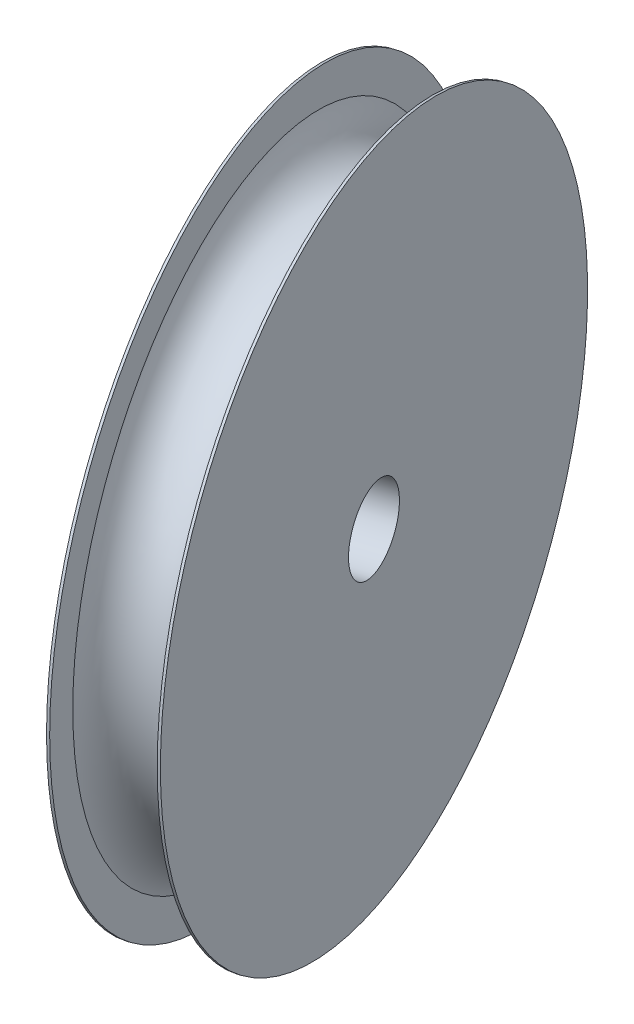
ISO-10303-21;
HEADER;
FILE_DESCRIPTION(('STEP AP214'),'2;1');
FILE_NAME('part.step','',(''),(''),'','','');
FILE_SCHEMA(('AUTOMOTIVE_DESIGN { 1 0 10303 214 1 1 1 1 }'));
ENDSEC;
DATA;
#1=APPLICATION_CONTEXT('core data for automotive mechanical design processes');
#2=APPLICATION_PROTOCOL_DEFINITION('international standard','automotive_design',2000,#1);
#3=PRODUCT_CONTEXT('',#1,'mechanical');
#4=PRODUCT('Part','Part','',(#3));
#5=PRODUCT_RELATED_PRODUCT_CATEGORY('part','',(#4));
#6=PRODUCT_DEFINITION_FORMATION('','',#4);
#7=PRODUCT_DEFINITION_CONTEXT('part definition',#1,'design');
#8=PRODUCT_DEFINITION('design','',#6,#7);
#9=PRODUCT_DEFINITION_SHAPE('','',#8);
#10=(LENGTH_UNIT() NAMED_UNIT(*) SI_UNIT(.MILLI.,.METRE.));
#11=(NAMED_UNIT(*) PLANE_ANGLE_UNIT() SI_UNIT($,.RADIAN.));
#12=(NAMED_UNIT(*) SI_UNIT($,.STERADIAN.) SOLID_ANGLE_UNIT());
#13=UNCERTAINTY_MEASURE_WITH_UNIT(LENGTH_MEASURE(1.E-05),#10,'distance_accuracy_value','');
#14=(GEOMETRIC_REPRESENTATION_CONTEXT(3) GLOBAL_UNCERTAINTY_ASSIGNED_CONTEXT((#13)) GLOBAL_UNIT_ASSIGNED_CONTEXT((#10,
#11,#12)) REPRESENTATION_CONTEXT('',''));
#15=CARTESIAN_POINT('',(0.,0.,0.));
#16=DIRECTION('',(0.,0.,1.));
#17=DIRECTION('',(1.,0.,0.));
#18=AXIS2_PLACEMENT_3D('',#15,#16,#17);
#19=CARTESIAN_POINT('',(-81.5737659680861,-109.238258959924,112.153223812812));
#20=DIRECTION('',(-0.95265446278378,0.,0.304055051821456));
#21=DIRECTION('',(0.304055051821456,0.,0.95265446278378));
#22=AXIS2_PLACEMENT_3D('',#19,#20,#21);
#23=CYLINDRICAL_SURFACE('',#22,13.85);
#24=CARTESIAN_POINT('',(-77.4647215977303,-109.238258959924,110.841755964003));
#25=DIRECTION('',(-0.95265446278378,0.,0.304055051821456));
#26=DIRECTION('',(0.304055051821456,0.,0.95265446278378));
#27=AXIS2_PLACEMENT_3D('',#24,#25,#26);
#28=CIRCLE('',#27,13.85);
#29=CARTESIAN_POINT('',(-73.2535591300031,-109.238258959924,124.036020273559));
#30=VERTEX_POINT('',#29);
#31=EDGE_CURVE('E61',#30,#30,#28,.T.);
#32=ORIENTED_EDGE('',*,*,#31,.T.);
#33=EDGE_LOOP('',(#32));
#34=FACE_BOUND('',#33,.T.);
#35=CARTESIAN_POINT('',(-77.5647503163226,-109.238258959924,110.873681744445));
#36=DIRECTION('',(-0.95265446278378,0.,0.304055051821456));
#37=DIRECTION('',(0.304055051821456,0.,0.95265446278378));
#38=AXIS2_PLACEMENT_3D('',#35,#36,#37);
#39=CIRCLE('',#38,13.85);
#40=CARTESIAN_POINT('',(-73.3535878485954,-109.238258959924,124.067946054));
#41=VERTEX_POINT('',#40);
#42=EDGE_CURVE('E10',#41,#41,#39,.T.);
#43=ORIENTED_EDGE('',*,*,#42,.F.);
#44=EDGE_LOOP('',(#43));
#45=FACE_BOUND('',#44,.T.);
#46=ADVANCED_FACE('F33',(#34,#45),#23,.T.);
#47=CARTESIAN_POINT('',(-77.5647503163226,-107.588258959924,110.873681744445));
#48=DIRECTION('',(-0.95265446278378,0.,0.304055051821456));
#49=DIRECTION('',(0.304055051821456,0.,0.95265446278378));
#50=AXIS2_PLACEMENT_3D('',#47,#48,#49);
#51=PLANE('',#50);
#52=ORIENTED_EDGE('',*,*,#42,.T.);
#53=EDGE_LOOP('',(#52));
#54=FACE_BOUND('',#53,.T.);
#55=CARTESIAN_POINT('',(-77.5647503163226,-109.238258959924,110.873681744445));
#56=DIRECTION('',(-0.95265446278378,0.,0.304055051821456));
#57=DIRECTION('',(0.304055051821456,0.,0.95265446278378));
#58=AXIS2_PLACEMENT_3D('',#55,#56,#57);
#59=CIRCLE('',#58,1.64999999999998);
#60=CARTESIAN_POINT('',(-77.0630594808172,-109.238258959924,112.445561608038));
#61=VERTEX_POINT('',#60);
#62=EDGE_CURVE('E39',#61,#61,#59,.T.);
#63=ORIENTED_EDGE('',*,*,#62,.F.);
#64=EDGE_LOOP('',(#63));
#65=FACE_BOUND('',#64,.T.);
#66=ADVANCED_FACE('F79',(#54,#65),#51,.T.);
#67=CARTESIAN_POINT('',(-81.5737659680861,-109.238258959924,112.153223812812));
#68=DIRECTION('',(-0.95265446278378,0.,0.304055051821456));
#69=DIRECTION('',(0.304055051821456,0.,0.95265446278378));
#70=AXIS2_PLACEMENT_3D('',#67,#68,#69);
#71=CYLINDRICAL_SURFACE('',#70,1.64999999999998);
#72=ORIENTED_EDGE('',*,*,#62,.T.);
#73=EDGE_LOOP('',(#72));
#74=FACE_BOUND('',#73,.T.);
#75=CARTESIAN_POINT('',(-73.9351368131164,-109.238258959924,109.715231997005));
#76=DIRECTION('',(-0.95265446278378,0.,0.304055051821456));
#77=DIRECTION('',(0.304055051821456,0.,0.95265446278378));
#78=AXIS2_PLACEMENT_3D('',#75,#76,#77);
#79=CIRCLE('',#78,1.64999999999998);
#80=CARTESIAN_POINT('',(-73.433445977611,-109.238258959924,111.287111860598));
#81=VERTEX_POINT('',#80);
#82=EDGE_CURVE('E43',#81,#81,#79,.T.);
#83=ORIENTED_EDGE('',*,*,#82,.F.);
#84=EDGE_LOOP('',(#83));
#85=FACE_BOUND('',#84,.T.);
#86=ADVANCED_FACE('F83',(#74,#85),#71,.F.);
#87=CARTESIAN_POINT('',(-73.9351368131164,-107.588258959924,109.715231997005));
#88=DIRECTION('',(0.95265446278378,0.,-0.304055051821456));
#89=DIRECTION('',(-0.304055051821456,0.,-0.95265446278378));
#90=AXIS2_PLACEMENT_3D('',#87,#88,#89);
#91=PLANE('',#90);
#92=ORIENTED_EDGE('',*,*,#82,.T.);
#93=EDGE_LOOP('',(#92));
#94=FACE_BOUND('',#93,.T.);
#95=CARTESIAN_POINT('',(-73.9351368131164,-109.238258959924,109.715231997005));
#96=DIRECTION('',(-0.95265446278378,0.,0.304055051821456));
#97=DIRECTION('',(0.304055051821456,0.,0.95265446278378));
#98=AXIS2_PLACEMENT_3D('',#95,#96,#97);
#99=CIRCLE('',#98,13.85);
#100=CARTESIAN_POINT('',(-69.7239743453892,-109.238258959924,122.90949630656));
#101=VERTEX_POINT('',#100);
#102=EDGE_CURVE('E47',#101,#101,#99,.T.);
#103=ORIENTED_EDGE('',*,*,#102,.F.);
#104=EDGE_LOOP('',(#103));
#105=FACE_BOUND('',#104,.T.);
#106=ADVANCED_FACE('F87',(#94,#105),#91,.T.);
#107=CARTESIAN_POINT('',(-81.5737659680861,-109.238258959924,112.153223812812));
#108=DIRECTION('',(-0.95265446278378,0.,0.304055051821456));
#109=DIRECTION('',(0.304055051821456,0.,0.95265446278378));
#110=AXIS2_PLACEMENT_3D('',#107,#108,#109);
#111=CYLINDRICAL_SURFACE('',#110,13.85);
#112=ORIENTED_EDGE('',*,*,#102,.T.);
#113=EDGE_LOOP('',(#112));
#114=FACE_BOUND('',#113,.T.);
#115=CARTESIAN_POINT('',(-74.0351655317087,-109.238258959924,109.747157777446));
#116=DIRECTION('',(-0.95265446278378,0.,0.304055051821456));
#117=DIRECTION('',(0.304055051821456,0.,0.95265446278378));
#118=AXIS2_PLACEMENT_3D('',#115,#116,#117);
#119=CIRCLE('',#118,13.85);
#120=CARTESIAN_POINT('',(-69.8240030639815,-109.238258959924,122.941422087002));
#121=VERTEX_POINT('',#120);
#122=EDGE_CURVE('E52',#121,#121,#119,.T.);
#123=ORIENTED_EDGE('',*,*,#122,.F.);
#124=EDGE_LOOP('',(#123));
#125=FACE_BOUND('',#124,.T.);
#126=ADVANCED_FACE('F93',(#114,#125),#111,.T.);
#127=CARTESIAN_POINT('',(-74.0351655317087,-96.8882589599244,109.747157777446));
#128=DIRECTION('',(-0.95265446278378,0.,0.304055051821456));
#129=DIRECTION('',(0.304055051821456,0.,0.95265446278378));
#130=AXIS2_PLACEMENT_3D('',#127,#128,#129);
#131=PLANE('',#130);
#132=ORIENTED_EDGE('',*,*,#122,.T.);
#133=EDGE_LOOP('',(#132));
#134=FACE_BOUND('',#133,.T.);
#135=CARTESIAN_POINT('',(-74.0351655317087,-109.238258959924,109.747157777446));
#136=DIRECTION('',(-0.95265446278378,0.,0.304055051821456));
#137=DIRECTION('',(0.304055051821456,0.,0.95265446278378));
#138=AXIS2_PLACEMENT_3D('',#135,#136,#137);
#139=CIRCLE('',#138,12.35);
#140=CARTESIAN_POINT('',(-70.2800856417137,-109.238258959924,121.512440392826));
#141=VERTEX_POINT('',#140);
#142=EDGE_CURVE('E55',#141,#141,#139,.T.);
#143=ORIENTED_EDGE('',*,*,#142,.F.);
#144=EDGE_LOOP('',(#143));
#145=FACE_BOUND('',#144,.T.);
#146=ADVANCED_FACE('F75',(#134,#145),#131,.T.);
#147=CARTESIAN_POINT('',(-75.7499435647195,-109.238258959924,110.294456870725));
#148=DIRECTION('',(-0.95265446278378,0.,0.304055051821456));
#149=DIRECTION('',(0.304055051821456,0.,0.95265446278378));
#150=AXIS2_PLACEMENT_3D('',#147,#148,#149);
#151=TOROIDAL_SURFACE('',#150,12.9290880322801,1.89085772842116);
#152=ORIENTED_EDGE('',*,*,#142,.T.);
#153=EDGE_LOOP('',(#152));
#154=FACE_BOUND('',#153,.T.);
#155=CARTESIAN_POINT('',(-77.4647215977303,-109.238258959924,110.841755964003));
#156=DIRECTION('',(-0.95265446278378,0.,0.304055051821456));
#157=DIRECTION('',(0.304055051821456,0.,0.95265446278378));
#158=AXIS2_PLACEMENT_3D('',#155,#156,#157);
#159=CIRCLE('',#158,12.35);
#160=CARTESIAN_POINT('',(-73.7096417077353,-109.238258959924,122.607038579383));
#161=VERTEX_POINT('',#160);
#162=EDGE_CURVE('E58',#161,#161,#159,.T.);
#163=ORIENTED_EDGE('',*,*,#162,.F.);
#164=EDGE_LOOP('',(#163));
#165=FACE_BOUND('',#164,.T.);
#166=ADVANCED_FACE('F69',(#154,#165),#151,.F.);
#167=CARTESIAN_POINT('',(-77.4647215977303,-96.8882589599244,110.841755964003));
#168=DIRECTION('',(0.95265446278378,0.,-0.304055051821456));
#169=DIRECTION('',(-0.304055051821456,0.,-0.95265446278378));
#170=AXIS2_PLACEMENT_3D('',#167,#168,#169);
#171=PLANE('',#170);
#172=ORIENTED_EDGE('',*,*,#162,.T.);
#173=EDGE_LOOP('',(#172));
#174=FACE_BOUND('',#173,.T.);
#175=ORIENTED_EDGE('',*,*,#31,.F.);
#176=EDGE_LOOP('',(#175));
#177=FACE_BOUND('',#176,.T.);
#178=ADVANCED_FACE('F67',(#174,#177),#171,.T.);
#179=CLOSED_SHELL('',(#46,#66,#86,#106,#126,#146,#166,#178));
#180=MANIFOLD_SOLID_BREP('B2',#179);
#181=ADVANCED_BREP_SHAPE_REPRESENTATION('',(#18,#180),#14);
#182=SHAPE_DEFINITION_REPRESENTATION(#9,#181);
ENDSEC;
END-ISO-10303-21;
